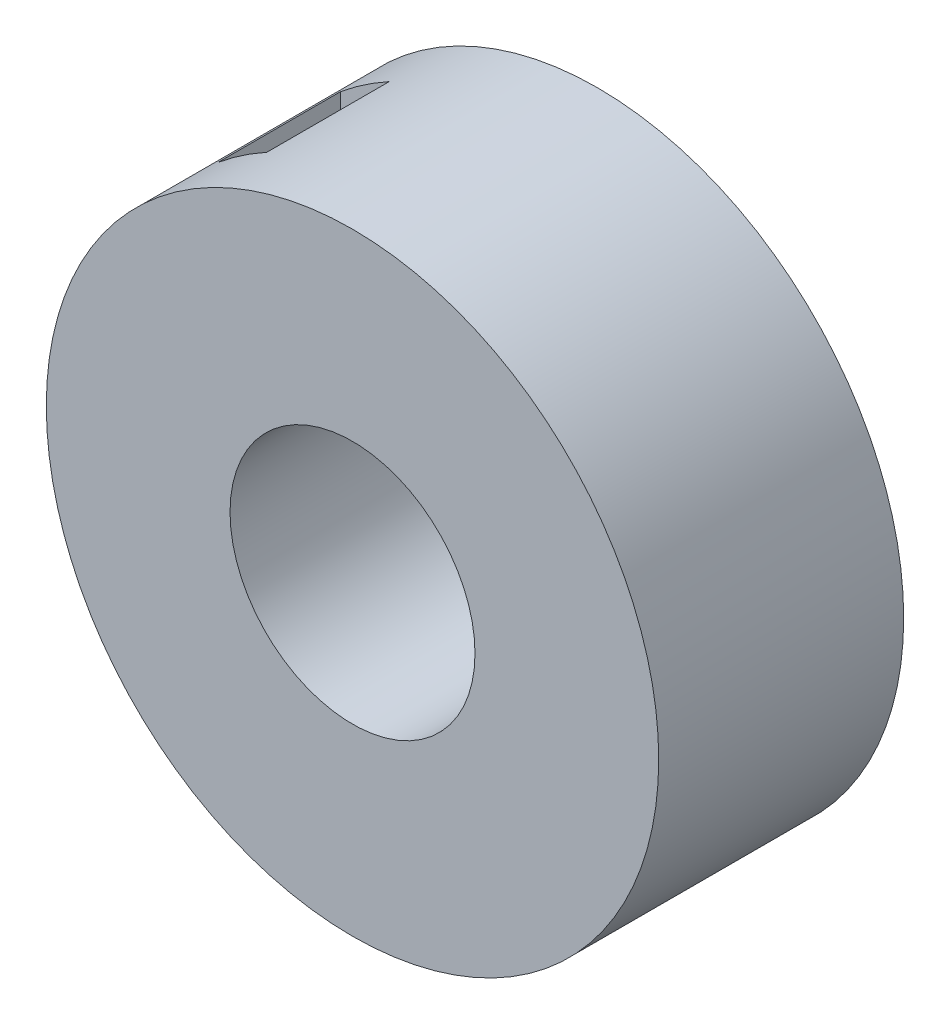
ISO-10303-21;
HEADER;
FILE_DESCRIPTION(('STEP AP214'),'2;1');
FILE_NAME('part.step','',(''),(''),'','','');
FILE_SCHEMA(('AUTOMOTIVE_DESIGN { 1 0 10303 214 1 1 1 1 }'));
ENDSEC;
DATA;
#1=APPLICATION_CONTEXT('core data for automotive mechanical design processes');
#2=APPLICATION_PROTOCOL_DEFINITION('international standard','automotive_design',2000,#1);
#3=PRODUCT_CONTEXT('',#1,'mechanical');
#4=PRODUCT('Part','Part','',(#3));
#5=PRODUCT_RELATED_PRODUCT_CATEGORY('part','',(#4));
#6=PRODUCT_DEFINITION_FORMATION('','',#4);
#7=PRODUCT_DEFINITION_CONTEXT('part definition',#1,'design');
#8=PRODUCT_DEFINITION('design','',#6,#7);
#9=PRODUCT_DEFINITION_SHAPE('','',#8);
#10=(LENGTH_UNIT() NAMED_UNIT(*) SI_UNIT(.MILLI.,.METRE.));
#11=(NAMED_UNIT(*) PLANE_ANGLE_UNIT() SI_UNIT($,.RADIAN.));
#12=(NAMED_UNIT(*) SI_UNIT($,.STERADIAN.) SOLID_ANGLE_UNIT());
#13=UNCERTAINTY_MEASURE_WITH_UNIT(LENGTH_MEASURE(1.E-05),#10,'distance_accuracy_value','');
#14=(GEOMETRIC_REPRESENTATION_CONTEXT(3) GLOBAL_UNCERTAINTY_ASSIGNED_CONTEXT((#13)) GLOBAL_UNIT_ASSIGNED_CONTEXT((#10,
#11,#12)) REPRESENTATION_CONTEXT('',''));
#15=CARTESIAN_POINT('',(0.,0.,0.));
#16=DIRECTION('',(0.,0.,1.));
#17=DIRECTION('',(1.,0.,0.));
#18=AXIS2_PLACEMENT_3D('',#15,#16,#17);
#19=CARTESIAN_POINT('',(0.,0.,-0.25));
#20=DIRECTION('',(0.,0.,1.));
#21=DIRECTION('',(1.,0.,0.));
#22=AXIS2_PLACEMENT_3D('',#19,#20,#21);
#23=CYLINDRICAL_SURFACE('',#22,0.625);
#24=CARTESIAN_POINT('',(0.,0.,0.125));
#25=DIRECTION('',(0.,0.,1.));
#26=DIRECTION('',(1.,0.,0.));
#27=AXIS2_PLACEMENT_3D('',#24,#25,#26);
#28=CIRCLE('',#27,0.625);
#29=CARTESIAN_POINT('',(-0.4,-0.480234317807463,0.125));
#30=VERTEX_POINT('',#29);
#31=CARTESIAN_POINT('',(-0.3,-0.548292804986533,0.125));
#32=VERTEX_POINT('',#31);
#33=EDGE_CURVE('E136',#30,#32,#28,.T.);
#34=ORIENTED_EDGE('',*,*,#33,.T.);
#35=DIRECTION('',(0.,0.,-1.));
#36=VECTOR('',#35,1.);
#37=CARTESIAN_POINT('',(-0.3,-0.548292804986533,0.125));
#38=LINE('',#37,#36);
#39=CARTESIAN_POINT('',(-0.3,-0.548292804986533,-0.125));
#40=VERTEX_POINT('',#39);
#41=EDGE_CURVE('E102',#32,#40,#38,.T.);
#42=ORIENTED_EDGE('',*,*,#41,.T.);
#43=CARTESIAN_POINT('',(0.,0.,-0.125));
#44=DIRECTION('',(0.,0.,1.));
#45=DIRECTION('',(1.,0.,0.));
#46=AXIS2_PLACEMENT_3D('',#43,#44,#45);
#47=CIRCLE('',#46,0.625);
#48=CARTESIAN_POINT('',(-0.4,-0.480234317807463,-0.125));
#49=VERTEX_POINT('',#48);
#50=EDGE_CURVE('E86',#49,#40,#47,.T.);
#51=ORIENTED_EDGE('',*,*,#50,.F.);
#52=DIRECTION('',(0.,0.,-1.));
#53=VECTOR('',#52,1.);
#54=CARTESIAN_POINT('',(-0.4,-0.480234317807463,0.125));
#55=LINE('',#54,#53);
#56=EDGE_CURVE('E84',#30,#49,#55,.T.);
#57=ORIENTED_EDGE('',*,*,#56,.F.);
#58=EDGE_LOOP('',(#34,#42,#51,#57));
#59=FACE_BOUND('',#58,.T.);
#60=CARTESIAN_POINT('',(0.,0.,0.125));
#61=DIRECTION('',(0.,0.,1.));
#62=DIRECTION('',(1.,0.,0.));
#63=AXIS2_PLACEMENT_3D('',#60,#61,#62);
#64=CIRCLE('',#63,0.625);
#65=CARTESIAN_POINT('',(-0.3,0.548292804986533,0.125));
#66=VERTEX_POINT('',#65);
#67=CARTESIAN_POINT('',(-0.4,0.480234317807464,0.125));
#68=VERTEX_POINT('',#67);
#69=EDGE_CURVE('E96',#66,#68,#64,.T.);
#70=ORIENTED_EDGE('',*,*,#69,.T.);
#71=DIRECTION('',(0.,0.,-1.));
#72=VECTOR('',#71,1.);
#73=CARTESIAN_POINT('',(-0.4,0.480234317807464,0.125));
#74=LINE('',#73,#72);
#75=CARTESIAN_POINT('',(-0.4,0.480234317807464,-0.125));
#76=VERTEX_POINT('',#75);
#77=EDGE_CURVE('E81',#68,#76,#74,.T.);
#78=ORIENTED_EDGE('',*,*,#77,.T.);
#79=CARTESIAN_POINT('',(0.,0.,-0.125));
#80=DIRECTION('',(0.,0.,1.));
#81=DIRECTION('',(1.,0.,0.));
#82=AXIS2_PLACEMENT_3D('',#79,#80,#81);
#83=CIRCLE('',#82,0.625);
#84=CARTESIAN_POINT('',(-0.3,0.548292804986533,-0.125));
#85=VERTEX_POINT('',#84);
#86=EDGE_CURVE('E87',#85,#76,#83,.T.);
#87=ORIENTED_EDGE('',*,*,#86,.F.);
#88=DIRECTION('',(0.,0.,-1.));
#89=VECTOR('',#88,1.);
#90=CARTESIAN_POINT('',(-0.3,0.548292804986533,0.125));
#91=LINE('',#90,#89);
#92=EDGE_CURVE('E142',#66,#85,#91,.T.);
#93=ORIENTED_EDGE('',*,*,#92,.F.);
#94=EDGE_LOOP('',(#70,#78,#87,#93));
#95=FACE_BOUND('',#94,.T.);
#96=CARTESIAN_POINT('',(0.,0.,-0.25));
#97=DIRECTION('',(0.,0.,1.));
#98=DIRECTION('',(1.,0.,0.));
#99=AXIS2_PLACEMENT_3D('',#96,#97,#98);
#100=CIRCLE('',#99,0.625);
#101=CARTESIAN_POINT('',(0.625,0.,-0.25));
#102=VERTEX_POINT('',#101);
#103=EDGE_CURVE('E11',#102,#102,#100,.T.);
#104=ORIENTED_EDGE('',*,*,#103,.T.);
#105=EDGE_LOOP('',(#104));
#106=FACE_BOUND('',#105,.T.);
#107=CARTESIAN_POINT('',(0.,0.,0.25));
#108=DIRECTION('',(0.,0.,1.));
#109=DIRECTION('',(1.,0.,0.));
#110=AXIS2_PLACEMENT_3D('',#107,#108,#109);
#111=CIRCLE('',#110,0.625);
#112=CARTESIAN_POINT('',(0.625,0.,0.25));
#113=VERTEX_POINT('',#112);
#114=EDGE_CURVE('E100',#113,#113,#111,.T.);
#115=ORIENTED_EDGE('',*,*,#114,.F.);
#116=EDGE_LOOP('',(#115));
#117=FACE_BOUND('',#116,.T.);
#118=ADVANCED_FACE('F41',(#59,#95,#106,#117),#23,.T.);
#119=CARTESIAN_POINT('',(0.,0.,-0.25));
#120=DIRECTION('',(0.,0.,1.));
#121=DIRECTION('',(1.,0.,0.));
#122=AXIS2_PLACEMENT_3D('',#119,#120,#121);
#123=PLANE('',#122);
#124=CARTESIAN_POINT('',(0.,0.,-0.25));
#125=DIRECTION('',(0.,0.,1.));
#126=DIRECTION('',(1.,0.,0.));
#127=AXIS2_PLACEMENT_3D('',#124,#125,#126);
#128=CIRCLE('',#127,0.25);
#129=CARTESIAN_POINT('',(0.25,0.,-0.25));
#130=VERTEX_POINT('',#129);
#131=EDGE_CURVE('E48',#130,#130,#128,.T.);
#132=ORIENTED_EDGE('',*,*,#131,.T.);
#133=EDGE_LOOP('',(#132));
#134=FACE_BOUND('',#133,.T.);
#135=ORIENTED_EDGE('',*,*,#103,.F.);
#136=EDGE_LOOP('',(#135));
#137=FACE_BOUND('',#136,.T.);
#138=ADVANCED_FACE('F110',(#134,#137),#123,.F.);
#139=CARTESIAN_POINT('',(0.,0.,-0.25));
#140=DIRECTION('',(0.,0.,1.));
#141=DIRECTION('',(1.,0.,0.));
#142=AXIS2_PLACEMENT_3D('',#139,#140,#141);
#143=CYLINDRICAL_SURFACE('',#142,0.25);
#144=ORIENTED_EDGE('',*,*,#131,.F.);
#145=EDGE_LOOP('',(#144));
#146=FACE_BOUND('',#145,.T.);
#147=CARTESIAN_POINT('',(0.,0.,0.25));
#148=DIRECTION('',(0.,0.,1.));
#149=DIRECTION('',(1.,0.,0.));
#150=AXIS2_PLACEMENT_3D('',#147,#148,#149);
#151=CIRCLE('',#150,0.25);
#152=CARTESIAN_POINT('',(0.25,0.,0.25));
#153=VERTEX_POINT('',#152);
#154=EDGE_CURVE('E97',#153,#153,#151,.T.);
#155=ORIENTED_EDGE('',*,*,#154,.T.);
#156=EDGE_LOOP('',(#155));
#157=FACE_BOUND('',#156,.T.);
#158=ADVANCED_FACE('F113',(#146,#157),#143,.F.);
#159=CARTESIAN_POINT('',(0.,0.,0.25));
#160=DIRECTION('',(0.,0.,1.));
#161=DIRECTION('',(1.,0.,0.));
#162=AXIS2_PLACEMENT_3D('',#159,#160,#161);
#163=PLANE('',#162);
#164=ORIENTED_EDGE('',*,*,#114,.T.);
#165=EDGE_LOOP('',(#164));
#166=FACE_BOUND('',#165,.T.);
#167=ORIENTED_EDGE('',*,*,#154,.F.);
#168=EDGE_LOOP('',(#167));
#169=FACE_BOUND('',#168,.T.);
#170=ADVANCED_FACE('F116',(#166,#169),#163,.T.);
#171=CARTESIAN_POINT('',(-0.4,-0.480234317807464,0.125));
#172=DIRECTION('',(1.,0.,0.));
#173=DIRECTION('',(0.,0.,-1.));
#174=AXIS2_PLACEMENT_3D('',#171,#172,#173);
#175=PLANE('',#174);
#176=ORIENTED_EDGE('',*,*,#77,.F.);
#177=DIRECTION('',(0.,-1.,0.));
#178=VECTOR('',#177,1.);
#179=CARTESIAN_POINT('',(-0.4,-0.480234317807464,0.125));
#180=LINE('',#179,#178);
#181=EDGE_CURVE('E140',#68,#30,#180,.T.);
#182=ORIENTED_EDGE('',*,*,#181,.T.);
#183=ORIENTED_EDGE('',*,*,#56,.T.);
#184=DIRECTION('',(0.,-1.,0.));
#185=VECTOR('',#184,1.);
#186=CARTESIAN_POINT('',(-0.4,-0.480234317807464,-0.125));
#187=LINE('',#186,#185);
#188=EDGE_CURVE('E55',#76,#49,#187,.T.);
#189=ORIENTED_EDGE('',*,*,#188,.F.);
#190=EDGE_LOOP('',(#176,#182,#183,#189));
#191=FACE_BOUND('',#190,.T.);
#192=ADVANCED_FACE('F79',(#191),#175,.T.);
#193=CARTESIAN_POINT('',(-0.3,-0.548292804986533,0.125));
#194=DIRECTION('',(-1.,0.,0.));
#195=DIRECTION('',(0.,0.,1.));
#196=AXIS2_PLACEMENT_3D('',#193,#194,#195);
#197=PLANE('',#196);
#198=ORIENTED_EDGE('',*,*,#41,.F.);
#199=DIRECTION('',(0.,1.,0.));
#200=VECTOR('',#199,1.);
#201=CARTESIAN_POINT('',(-0.3,-0.548292804986533,0.125));
#202=LINE('',#201,#200);
#203=EDGE_CURVE('E139',#32,#66,#202,.T.);
#204=ORIENTED_EDGE('',*,*,#203,.T.);
#205=ORIENTED_EDGE('',*,*,#92,.T.);
#206=DIRECTION('',(0.,1.,0.));
#207=VECTOR('',#206,1.);
#208=CARTESIAN_POINT('',(-0.3,-0.548292804986533,-0.125));
#209=LINE('',#208,#207);
#210=EDGE_CURVE('E60',#40,#85,#209,.T.);
#211=ORIENTED_EDGE('',*,*,#210,.F.);
#212=EDGE_LOOP('',(#198,#204,#205,#211));
#213=FACE_BOUND('',#212,.T.);
#214=ADVANCED_FACE('F126',(#213),#197,.T.);
#215=CARTESIAN_POINT('',(0.,0.,0.125));
#216=DIRECTION('',(0.,0.,1.));
#217=DIRECTION('',(1.,0.,0.));
#218=AXIS2_PLACEMENT_3D('',#215,#216,#217);
#219=PLANE('',#218);
#220=ORIENTED_EDGE('',*,*,#69,.F.);
#221=ORIENTED_EDGE('',*,*,#203,.F.);
#222=ORIENTED_EDGE('',*,*,#33,.F.);
#223=ORIENTED_EDGE('',*,*,#181,.F.);
#224=EDGE_LOOP('',(#220,#221,#222,#223));
#225=FACE_BOUND('',#224,.T.);
#226=ADVANCED_FACE('F148',(#225),#219,.F.);
#227=CARTESIAN_POINT('',(0.,0.,-0.125));
#228=DIRECTION('',(0.,0.,1.));
#229=DIRECTION('',(1.,0.,0.));
#230=AXIS2_PLACEMENT_3D('',#227,#228,#229);
#231=PLANE('',#230);
#232=ORIENTED_EDGE('',*,*,#86,.T.);
#233=ORIENTED_EDGE('',*,*,#188,.T.);
#234=ORIENTED_EDGE('',*,*,#50,.T.);
#235=ORIENTED_EDGE('',*,*,#210,.T.);
#236=EDGE_LOOP('',(#232,#233,#234,#235));
#237=FACE_BOUND('',#236,.T.);
#238=ADVANCED_FACE('F90',(#237),#231,.T.);
#239=CLOSED_SHELL('',(#118,#138,#158,#170,#192,#214,#226,#238));
#240=MANIFOLD_SOLID_BREP('B2',#239);
#241=ADVANCED_BREP_SHAPE_REPRESENTATION('',(#18,#240),#14);
#242=SHAPE_DEFINITION_REPRESENTATION(#9,#241);
ENDSEC;
END-ISO-10303-21;
